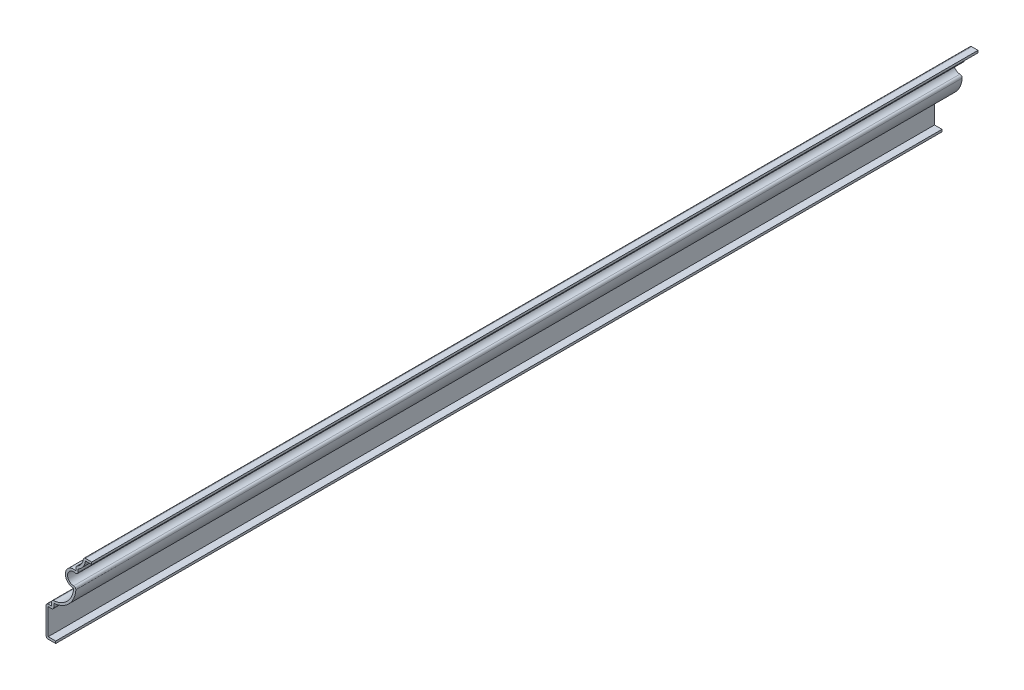
ISO-10303-21;
HEADER;
FILE_DESCRIPTION(('STEP AP214'),'2;1');
FILE_NAME('part.step','',(''),(''),'','','');
FILE_SCHEMA(('AUTOMOTIVE_DESIGN { 1 0 10303 214 1 1 1 1 }'));
ENDSEC;
DATA;
#1=APPLICATION_CONTEXT('core data for automotive mechanical design processes');
#2=APPLICATION_PROTOCOL_DEFINITION('international standard','automotive_design',2000,#1);
#3=PRODUCT_CONTEXT('',#1,'mechanical');
#4=PRODUCT('Part','Part','',(#3));
#5=PRODUCT_RELATED_PRODUCT_CATEGORY('part','',(#4));
#6=PRODUCT_DEFINITION_FORMATION('','',#4);
#7=PRODUCT_DEFINITION_CONTEXT('part definition',#1,'design');
#8=PRODUCT_DEFINITION('design','',#6,#7);
#9=PRODUCT_DEFINITION_SHAPE('','',#8);
#10=(LENGTH_UNIT() NAMED_UNIT(*) SI_UNIT(.MILLI.,.METRE.));
#11=(NAMED_UNIT(*) PLANE_ANGLE_UNIT() SI_UNIT($,.RADIAN.));
#12=(NAMED_UNIT(*) SI_UNIT($,.STERADIAN.) SOLID_ANGLE_UNIT());
#13=UNCERTAINTY_MEASURE_WITH_UNIT(LENGTH_MEASURE(1.E-05),#10,'distance_accuracy_value','');
#14=(GEOMETRIC_REPRESENTATION_CONTEXT(3) GLOBAL_UNCERTAINTY_ASSIGNED_CONTEXT((#13)) GLOBAL_UNIT_ASSIGNED_CONTEXT((#10,
#11,#12)) REPRESENTATION_CONTEXT('',''));
#15=CARTESIAN_POINT('',(0.,0.,0.));
#16=DIRECTION('',(0.,0.,1.));
#17=DIRECTION('',(1.,0.,0.));
#18=AXIS2_PLACEMENT_3D('',#15,#16,#17);
#19=CARTESIAN_POINT('',(15.875,49.53,-508.));
#20=DIRECTION('',(0.,-1.,0.));
#21=DIRECTION('',(0.,0.,-1.));
#22=AXIS2_PLACEMENT_3D('',#19,#20,#21);
#23=PLANE('',#22);
#24=DIRECTION('',(1.,0.,0.));
#25=VECTOR('',#24,1.);
#26=CARTESIAN_POINT('',(15.875,49.53,0.));
#27=LINE('',#26,#25);
#28=CARTESIAN_POINT('',(17.0666574151242,49.53,0.));
#29=VERTEX_POINT('',#28);
#30=CARTESIAN_POINT('',(20.6375,49.53,0.));
#31=VERTEX_POINT('',#30);
#32=EDGE_CURVE('E295',#29,#31,#27,.T.);
#33=ORIENTED_EDGE('',*,*,#32,.F.);
#34=DIRECTION('',(0.,0.,1.));
#35=VECTOR('',#34,1.);
#36=CARTESIAN_POINT('',(17.0666574151242,49.53,-508.));
#37=LINE('',#36,#35);
#38=CARTESIAN_POINT('',(17.0666574151242,49.53,-508.));
#39=VERTEX_POINT('',#38);
#40=EDGE_CURVE('E247',#39,#29,#37,.T.);
#41=ORIENTED_EDGE('',*,*,#40,.F.);
#42=DIRECTION('',(1.,0.,0.));
#43=VECTOR('',#42,1.);
#44=CARTESIAN_POINT('',(15.875,49.53,-508.));
#45=LINE('',#44,#43);
#46=CARTESIAN_POINT('',(20.6375,49.53,-508.));
#47=VERTEX_POINT('',#46);
#48=EDGE_CURVE('E228',#39,#47,#45,.T.);
#49=ORIENTED_EDGE('',*,*,#48,.T.);
#50=DIRECTION('',(0.,0.,1.));
#51=VECTOR('',#50,1.);
#52=CARTESIAN_POINT('',(20.6375,49.53,-508.));
#53=LINE('',#52,#51);
#54=EDGE_CURVE('E237',#47,#31,#53,.T.);
#55=ORIENTED_EDGE('',*,*,#54,.T.);
#56=EDGE_LOOP('',(#33,#41,#49,#55));
#57=FACE_BOUND('',#56,.T.);
#58=ADVANCED_FACE('F35',(#57),#23,.T.);
#59=CARTESIAN_POINT('',(8.9863808914025,50.6671459773409,-508.));
#60=DIRECTION('',(0.,0.,1.));
#61=DIRECTION('',(1.,0.,0.));
#62=AXIS2_PLACEMENT_3D('',#59,#60,#61);
#63=CYLINDRICAL_SURFACE('',#62,8.15990010193699);
#64=CARTESIAN_POINT('',(8.9863808914025,50.6671459773409,0.));
#65=DIRECTION('',(0.,0.,1.));
#66=DIRECTION('',(1.,0.,0.));
#67=AXIS2_PLACEMENT_3D('',#64,#65,#66);
#68=CIRCLE('',#67,8.15990010193699);
#69=CARTESIAN_POINT('',(12.8339210417454,43.4712857462712,0.));
#70=VERTEX_POINT('',#69);
#71=EDGE_CURVE('E248',#70,#29,#68,.T.);
#72=ORIENTED_EDGE('',*,*,#71,.F.);
#73=DIRECTION('',(0.,0.,1.));
#74=VECTOR('',#73,1.);
#75=CARTESIAN_POINT('',(12.8339210417454,43.4712857462712,-508.));
#76=LINE('',#75,#74);
#77=CARTESIAN_POINT('',(12.8339210417454,43.4712857462712,-508.));
#78=VERTEX_POINT('',#77);
#79=EDGE_CURVE('E342',#78,#70,#76,.T.);
#80=ORIENTED_EDGE('',*,*,#79,.F.);
#81=CARTESIAN_POINT('',(8.9863808914025,50.6671459773409,-508.));
#82=DIRECTION('',(0.,0.,1.));
#83=DIRECTION('',(1.,0.,0.));
#84=AXIS2_PLACEMENT_3D('',#81,#82,#83);
#85=CIRCLE('',#84,8.15990010193699);
#86=EDGE_CURVE('E245',#78,#39,#85,.T.);
#87=ORIENTED_EDGE('',*,*,#86,.T.);
#88=ORIENTED_EDGE('',*,*,#40,.T.);
#89=EDGE_LOOP('',(#72,#80,#87,#88));
#90=FACE_BOUND('',#89,.T.);
#91=ADVANCED_FACE('F473',(#90),#63,.T.);
#92=CARTESIAN_POINT('',(12.8339210417454,41.8962942535993,-508.));
#93=DIRECTION('',(1.,0.,0.));
#94=DIRECTION('',(0.,0.,-1.));
#95=AXIS2_PLACEMENT_3D('',#92,#93,#94);
#96=PLANE('',#95);
#97=DIRECTION('',(0.,1.,0.));
#98=VECTOR('',#97,1.);
#99=CARTESIAN_POINT('',(12.8339210417454,41.8962942535993,0.));
#100=LINE('',#99,#98);
#101=CARTESIAN_POINT('',(12.8339210417454,41.8962942535993,0.));
#102=VERTEX_POINT('',#101);
#103=EDGE_CURVE('E251',#102,#70,#100,.T.);
#104=ORIENTED_EDGE('',*,*,#103,.F.);
#105=DIRECTION('',(0.,0.,1.));
#106=VECTOR('',#105,1.);
#107=CARTESIAN_POINT('',(12.8339210417454,41.8962942535993,-508.));
#108=LINE('',#107,#106);
#109=CARTESIAN_POINT('',(12.8339210417454,41.8962942535993,-508.));
#110=VERTEX_POINT('',#109);
#111=EDGE_CURVE('E411',#102,#110,#108,.F.);
#112=ORIENTED_EDGE('',*,*,#111,.T.);
#113=DIRECTION('',(0.,1.,0.));
#114=VECTOR('',#113,1.);
#115=CARTESIAN_POINT('',(12.8339210417454,41.8962942535993,-508.));
#116=LINE('',#115,#114);
#117=EDGE_CURVE('E292',#110,#78,#116,.T.);
#118=ORIENTED_EDGE('',*,*,#117,.T.);
#119=ORIENTED_EDGE('',*,*,#79,.T.);
#120=EDGE_LOOP('',(#104,#112,#118,#119));
#121=FACE_BOUND('',#120,.T.);
#122=ADVANCED_FACE('F553',(#121),#96,.T.);
#123=CARTESIAN_POINT('',(10.2939210417454,37.30625,-508.));
#124=DIRECTION('',(0.,0.,1.));
#125=DIRECTION('',(1.,0.,0.));
#126=AXIS2_PLACEMENT_3D('',#123,#124,#125);
#127=CYLINDRICAL_SURFACE('',#126,3.4925);
#128=CARTESIAN_POINT('',(10.2939210417454,37.30625,-508.));
#129=DIRECTION('',(0.,0.,1.));
#130=DIRECTION('',(1.,0.,0.));
#131=AXIS2_PLACEMENT_3D('',#128,#129,#130);
#132=CIRCLE('',#131,3.4925);
#133=CARTESIAN_POINT('',(10.2939210417454,33.81375,-508.));
#134=VERTEX_POINT('',#133);
#135=CARTESIAN_POINT('',(11.2252543750787,40.6722824526395,-508.));
#136=VERTEX_POINT('',#135);
#137=EDGE_CURVE('E289',#134,#136,#132,.F.);
#138=ORIENTED_EDGE('',*,*,#137,.T.);
#139=DIRECTION('',(0.,0.,1.));
#140=VECTOR('',#139,1.);
#141=CARTESIAN_POINT('',(11.2252543750787,40.6722824526395,-508.));
#142=LINE('',#141,#140);
#143=CARTESIAN_POINT('',(11.2252543750787,40.6722824526395,0.));
#144=VERTEX_POINT('',#143);
#145=EDGE_CURVE('E408',#136,#144,#142,.T.);
#146=ORIENTED_EDGE('',*,*,#145,.T.);
#147=CARTESIAN_POINT('',(10.2939210417454,37.30625,0.));
#148=DIRECTION('',(0.,0.,1.));
#149=DIRECTION('',(1.,0.,0.));
#150=AXIS2_PLACEMENT_3D('',#147,#148,#149);
#151=CIRCLE('',#150,3.4925);
#152=CARTESIAN_POINT('',(10.2939210417454,33.81375,0.));
#153=VERTEX_POINT('',#152);
#154=EDGE_CURVE('E336',#153,#144,#151,.F.);
#155=ORIENTED_EDGE('',*,*,#154,.F.);
#156=DIRECTION('',(0.,0.,1.));
#157=VECTOR('',#156,1.);
#158=CARTESIAN_POINT('',(10.2939210417454,33.81375,-508.));
#159=LINE('',#158,#157);
#160=EDGE_CURVE('E406',#153,#134,#159,.F.);
#161=ORIENTED_EDGE('',*,*,#160,.T.);
#162=EDGE_LOOP('',(#138,#146,#155,#161));
#163=FACE_BOUND('',#162,.T.);
#164=ADVANCED_FACE('F484',(#163),#127,.F.);
#165=CARTESIAN_POINT('',(-2.38125,33.3375,-508.));
#166=DIRECTION('',(0.,0.,1.));
#167=DIRECTION('',(1.,0.,0.));
#168=AXIS2_PLACEMENT_3D('',#165,#166,#167);
#169=CYLINDRICAL_SURFACE('',#168,13.97);
#170=CARTESIAN_POINT('',(-2.38125,33.3375,-508.));
#171=DIRECTION('',(0.,0.,1.));
#172=DIRECTION('',(1.,0.,0.));
#173=AXIS2_PLACEMENT_3D('',#170,#171,#172);
#174=CIRCLE('',#173,13.97);
#175=CARTESIAN_POINT('',(-1.11125,19.4253470393688,-508.));
#176=VERTEX_POINT('',#175);
#177=CARTESIAN_POINT('',(11.5614381459199,32.464375,-508.));
#178=VERTEX_POINT('',#177);
#179=EDGE_CURVE('E286',#176,#178,#174,.T.);
#180=ORIENTED_EDGE('',*,*,#179,.T.);
#181=DIRECTION('',(0.,0.,1.));
#182=VECTOR('',#181,1.);
#183=CARTESIAN_POINT('',(11.5614381459199,32.464375,-508.));
#184=LINE('',#183,#182);
#185=CARTESIAN_POINT('',(11.5614381459199,32.464375,0.));
#186=VERTEX_POINT('',#185);
#187=EDGE_CURVE('E413',#178,#186,#184,.T.);
#188=ORIENTED_EDGE('',*,*,#187,.T.);
#189=CARTESIAN_POINT('',(-2.38125,33.3375,0.));
#190=DIRECTION('',(0.,0.,1.));
#191=DIRECTION('',(1.,0.,0.));
#192=AXIS2_PLACEMENT_3D('',#189,#190,#191);
#193=CIRCLE('',#192,13.97);
#194=CARTESIAN_POINT('',(-1.11125,19.4253470393688,0.));
#195=VERTEX_POINT('',#194);
#196=EDGE_CURVE('E333',#195,#186,#193,.T.);
#197=ORIENTED_EDGE('',*,*,#196,.F.);
#198=DIRECTION('',(0.,0.,1.));
#199=VECTOR('',#198,1.);
#200=CARTESIAN_POINT('',(-1.11125,19.4253470393688,-508.));
#201=LINE('',#200,#199);
#202=EDGE_CURVE('E345',#176,#195,#201,.T.);
#203=ORIENTED_EDGE('',*,*,#202,.F.);
#204=EDGE_LOOP('',(#180,#188,#197,#203));
#205=FACE_BOUND('',#204,.T.);
#206=ADVANCED_FACE('F492',(#205),#169,.T.);
#207=CARTESIAN_POINT('',(-1.11125,17.4625,-508.));
#208=DIRECTION('',(1.,0.,0.));
#209=DIRECTION('',(0.,0.,-1.));
#210=AXIS2_PLACEMENT_3D('',#207,#208,#209);
#211=PLANE('',#210);
#212=DIRECTION('',(0.,1.,0.));
#213=VECTOR('',#212,1.);
#214=CARTESIAN_POINT('',(-1.11125,17.4625,0.));
#215=LINE('',#214,#213);
#216=CARTESIAN_POINT('',(-1.11125,17.4625,0.));
#217=VERTEX_POINT('',#216);
#218=EDGE_CURVE('E331',#217,#195,#215,.T.);
#219=ORIENTED_EDGE('',*,*,#218,.F.);
#220=DIRECTION('',(0.,0.,1.));
#221=VECTOR('',#220,1.);
#222=CARTESIAN_POINT('',(-1.11125,17.4625,-508.));
#223=LINE('',#222,#221);
#224=CARTESIAN_POINT('',(-1.11125,17.4625,-508.));
#225=VERTEX_POINT('',#224);
#226=EDGE_CURVE('E426',#217,#225,#223,.F.);
#227=ORIENTED_EDGE('',*,*,#226,.T.);
#228=DIRECTION('',(0.,1.,0.));
#229=VECTOR('',#228,1.);
#230=CARTESIAN_POINT('',(-1.11125,17.4625,-508.));
#231=LINE('',#230,#229);
#232=EDGE_CURVE('E284',#225,#176,#231,.T.);
#233=ORIENTED_EDGE('',*,*,#232,.T.);
#234=ORIENTED_EDGE('',*,*,#202,.T.);
#235=EDGE_LOOP('',(#219,#227,#233,#234));
#236=FACE_BOUND('',#235,.T.);
#237=ADVANCED_FACE('F702',(#236),#211,.T.);
#238=CARTESIAN_POINT('',(-5.55625,16.1925,-508.));
#239=DIRECTION('',(0.,-1.,0.));
#240=DIRECTION('',(0.,0.,-1.));
#241=AXIS2_PLACEMENT_3D('',#238,#239,#240);
#242=PLANE('',#241);
#243=DIRECTION('',(1.,0.,0.));
#244=VECTOR('',#243,1.);
#245=CARTESIAN_POINT('',(-5.55625,16.1925,-508.));
#246=LINE('',#245,#244);
#247=CARTESIAN_POINT('',(-4.28625,16.1925,-508.));
#248=VERTEX_POINT('',#247);
#249=CARTESIAN_POINT('',(-2.38125,16.1925,-508.));
#250=VERTEX_POINT('',#249);
#251=EDGE_CURVE('E281',#248,#250,#246,.T.);
#252=ORIENTED_EDGE('',*,*,#251,.T.);
#253=DIRECTION('',(0.,0.,1.));
#254=VECTOR('',#253,1.);
#255=CARTESIAN_POINT('',(-2.38125,16.1925,-508.));
#256=LINE('',#255,#254);
#257=CARTESIAN_POINT('',(-2.38125,16.1925,0.));
#258=VERTEX_POINT('',#257);
#259=EDGE_CURVE('E423',#250,#258,#256,.T.);
#260=ORIENTED_EDGE('',*,*,#259,.T.);
#261=DIRECTION('',(1.,0.,0.));
#262=VECTOR('',#261,1.);
#263=CARTESIAN_POINT('',(-5.55625,16.1925,0.));
#264=LINE('',#263,#262);
#265=CARTESIAN_POINT('',(-4.28625,16.1925,0.));
#266=VERTEX_POINT('',#265);
#267=EDGE_CURVE('E328',#266,#258,#264,.T.);
#268=ORIENTED_EDGE('',*,*,#267,.F.);
#269=DIRECTION('',(0.,0.,1.));
#270=VECTOR('',#269,1.);
#271=CARTESIAN_POINT('',(-4.28625,16.1925,-508.));
#272=LINE('',#271,#270);
#273=EDGE_CURVE('E348',#248,#266,#272,.T.);
#274=ORIENTED_EDGE('',*,*,#273,.F.);
#275=EDGE_LOOP('',(#252,#260,#268,#274));
#276=FACE_BOUND('',#275,.T.);
#277=ADVANCED_FACE('F505',(#276),#242,.T.);
#278=CARTESIAN_POINT('',(-4.28625,0.,-508.));
#279=DIRECTION('',(1.,0.,0.));
#280=DIRECTION('',(0.,0.,-1.));
#281=AXIS2_PLACEMENT_3D('',#278,#279,#280);
#282=PLANE('',#281);
#283=DIRECTION('',(0.,1.,0.));
#284=VECTOR('',#283,1.);
#285=CARTESIAN_POINT('',(-4.28625,0.,0.));
#286=LINE('',#285,#284);
#287=CARTESIAN_POINT('',(-4.28625,1.27,0.));
#288=VERTEX_POINT('',#287);
#289=EDGE_CURVE('E325',#288,#266,#286,.T.);
#290=ORIENTED_EDGE('',*,*,#289,.F.);
#291=DIRECTION('',(0.,0.,1.));
#292=VECTOR('',#291,1.);
#293=CARTESIAN_POINT('',(-4.28625,1.27,-508.));
#294=LINE('',#293,#292);
#295=CARTESIAN_POINT('',(-4.28625,1.27,-508.));
#296=VERTEX_POINT('',#295);
#297=EDGE_CURVE('E350',#296,#288,#294,.T.);
#298=ORIENTED_EDGE('',*,*,#297,.F.);
#299=DIRECTION('',(0.,1.,0.));
#300=VECTOR('',#299,1.);
#301=CARTESIAN_POINT('',(-4.28625,0.,-508.));
#302=LINE('',#301,#300);
#303=EDGE_CURVE('E278',#296,#248,#302,.T.);
#304=ORIENTED_EDGE('',*,*,#303,.T.);
#305=ORIENTED_EDGE('',*,*,#273,.T.);
#306=EDGE_LOOP('',(#290,#298,#304,#305));
#307=FACE_BOUND('',#306,.T.);
#308=ADVANCED_FACE('F511',(#307),#282,.T.);
#309=CARTESIAN_POINT('',(0.,1.27,-508.));
#310=DIRECTION('',(0.,1.,0.));
#311=DIRECTION('',(-1.,0.,0.));
#312=AXIS2_PLACEMENT_3D('',#309,#310,#311);
#313=PLANE('',#312);
#314=DIRECTION('',(-1.,0.,0.));
#315=VECTOR('',#314,1.);
#316=CARTESIAN_POINT('',(0.,1.27,0.));
#317=LINE('',#316,#315);
#318=CARTESIAN_POINT('',(0.,1.27,0.));
#319=VERTEX_POINT('',#318);
#320=EDGE_CURVE('E322',#319,#288,#317,.T.);
#321=ORIENTED_EDGE('',*,*,#320,.F.);
#322=DIRECTION('',(0.,0.,1.));
#323=VECTOR('',#322,1.);
#324=CARTESIAN_POINT('',(0.,1.27,-508.));
#325=LINE('',#324,#323);
#326=CARTESIAN_POINT('',(0.,1.27,-508.));
#327=VERTEX_POINT('',#326);
#328=EDGE_CURVE('E352',#327,#319,#325,.T.);
#329=ORIENTED_EDGE('',*,*,#328,.F.);
#330=DIRECTION('',(-1.,0.,0.));
#331=VECTOR('',#330,1.);
#332=CARTESIAN_POINT('',(0.,1.27,-508.));
#333=LINE('',#332,#331);
#334=EDGE_CURVE('E275',#327,#296,#333,.T.);
#335=ORIENTED_EDGE('',*,*,#334,.T.);
#336=ORIENTED_EDGE('',*,*,#297,.T.);
#337=EDGE_LOOP('',(#321,#329,#335,#336));
#338=FACE_BOUND('',#337,.T.);
#339=ADVANCED_FACE('F515',(#338),#313,.T.);
#340=CARTESIAN_POINT('',(0.,1.27,-508.));
#341=DIRECTION('',(-1.,0.,0.));
#342=DIRECTION('',(0.,-1.,0.));
#343=AXIS2_PLACEMENT_3D('',#340,#341,#342);
#344=PLANE('',#343);
#345=DIRECTION('',(0.,-1.,0.));
#346=VECTOR('',#345,1.);
#347=CARTESIAN_POINT('',(0.,1.27,0.));
#348=LINE('',#347,#346);
#349=CARTESIAN_POINT('',(0.,0.,0.));
#350=VERTEX_POINT('',#349);
#351=EDGE_CURVE('E320',#319,#350,#348,.T.);
#352=ORIENTED_EDGE('',*,*,#351,.T.);
#353=DIRECTION('',(0.,0.,1.));
#354=VECTOR('',#353,1.);
#355=CARTESIAN_POINT('',(0.,0.,-508.));
#356=LINE('',#355,#354);
#357=CARTESIAN_POINT('',(0.,0.,-508.));
#358=VERTEX_POINT('',#357);
#359=EDGE_CURVE('E354',#358,#350,#356,.T.);
#360=ORIENTED_EDGE('',*,*,#359,.F.);
#361=DIRECTION('',(0.,-1.,0.));
#362=VECTOR('',#361,1.);
#363=CARTESIAN_POINT('',(0.,1.27,-508.));
#364=LINE('',#363,#362);
#365=EDGE_CURVE('E273',#327,#358,#364,.T.);
#366=ORIENTED_EDGE('',*,*,#365,.F.);
#367=ORIENTED_EDGE('',*,*,#328,.T.);
#368=EDGE_LOOP('',(#352,#360,#366,#367));
#369=FACE_BOUND('',#368,.T.);
#370=ADVANCED_FACE('F519',(#369),#344,.F.);
#371=CARTESIAN_POINT('',(0.,0.,-508.));
#372=DIRECTION('',(0.,1.,0.));
#373=DIRECTION('',(-1.,0.,0.));
#374=AXIS2_PLACEMENT_3D('',#371,#372,#373);
#375=PLANE('',#374);
#376=DIRECTION('',(-1.,0.,0.));
#377=VECTOR('',#376,1.);
#378=CARTESIAN_POINT('',(0.,0.,0.));
#379=LINE('',#378,#377);
#380=CARTESIAN_POINT('',(-4.28625,0.,0.));
#381=VERTEX_POINT('',#380);
#382=EDGE_CURVE('E317',#350,#381,#379,.T.);
#383=ORIENTED_EDGE('',*,*,#382,.T.);
#384=DIRECTION('',(0.,0.,1.));
#385=VECTOR('',#384,1.);
#386=CARTESIAN_POINT('',(-4.28625,0.,-508.));
#387=LINE('',#386,#385);
#388=CARTESIAN_POINT('',(-4.28625,0.,-508.));
#389=VERTEX_POINT('',#388);
#390=EDGE_CURVE('E421',#381,#389,#387,.F.);
#391=ORIENTED_EDGE('',*,*,#390,.T.);
#392=DIRECTION('',(-1.,0.,0.));
#393=VECTOR('',#392,1.);
#394=CARTESIAN_POINT('',(0.,0.,-508.));
#395=LINE('',#394,#393);
#396=EDGE_CURVE('E270',#358,#389,#395,.T.);
#397=ORIENTED_EDGE('',*,*,#396,.F.);
#398=ORIENTED_EDGE('',*,*,#359,.T.);
#399=EDGE_LOOP('',(#383,#391,#397,#398));
#400=FACE_BOUND('',#399,.T.);
#401=ADVANCED_FACE('F546',(#400),#375,.F.);
#402=CARTESIAN_POINT('',(-5.55625,0.,-508.));
#403=DIRECTION('',(1.,0.,0.));
#404=DIRECTION('',(0.,0.,-1.));
#405=AXIS2_PLACEMENT_3D('',#402,#403,#404);
#406=PLANE('',#405);
#407=DIRECTION('',(0.,1.,0.));
#408=VECTOR('',#407,1.);
#409=CARTESIAN_POINT('',(-5.55625,0.,-508.));
#410=LINE('',#409,#408);
#411=CARTESIAN_POINT('',(-5.55625,1.27,-508.));
#412=VERTEX_POINT('',#411);
#413=CARTESIAN_POINT('',(-5.55625,16.1925,-508.));
#414=VERTEX_POINT('',#413);
#415=EDGE_CURVE('E267',#412,#414,#410,.T.);
#416=ORIENTED_EDGE('',*,*,#415,.F.);
#417=DIRECTION('',(0.,0.,1.));
#418=VECTOR('',#417,1.);
#419=CARTESIAN_POINT('',(-5.55625,1.27,-508.));
#420=LINE('',#419,#418);
#421=CARTESIAN_POINT('',(-5.55625,1.27,0.));
#422=VERTEX_POINT('',#421);
#423=EDGE_CURVE('E418',#412,#422,#420,.T.);
#424=ORIENTED_EDGE('',*,*,#423,.T.);
#425=DIRECTION('',(0.,1.,0.));
#426=VECTOR('',#425,1.);
#427=CARTESIAN_POINT('',(-5.55625,0.,0.));
#428=LINE('',#427,#426);
#429=CARTESIAN_POINT('',(-5.55625,16.1925,0.));
#430=VERTEX_POINT('',#429);
#431=EDGE_CURVE('E314',#422,#430,#428,.T.);
#432=ORIENTED_EDGE('',*,*,#431,.T.);
#433=DIRECTION('',(0.,0.,1.));
#434=VECTOR('',#433,1.);
#435=CARTESIAN_POINT('',(-5.55625,16.1925,-508.));
#436=LINE('',#435,#434);
#437=EDGE_CURVE('E416',#430,#414,#436,.F.);
#438=ORIENTED_EDGE('',*,*,#437,.T.);
#439=EDGE_LOOP('',(#416,#424,#432,#438));
#440=FACE_BOUND('',#439,.T.);
#441=ADVANCED_FACE('F530',(#440),#406,.F.);
#442=CARTESIAN_POINT('',(-5.55625,17.4625,-508.));
#443=DIRECTION('',(0.,-1.,0.));
#444=DIRECTION('',(0.,0.,-1.));
#445=AXIS2_PLACEMENT_3D('',#442,#443,#444);
#446=PLANE('',#445);
#447=DIRECTION('',(1.,0.,0.));
#448=VECTOR('',#447,1.);
#449=CARTESIAN_POINT('',(-5.55625,17.4625,-508.));
#450=LINE('',#449,#448);
#451=CARTESIAN_POINT('',(-4.28625,17.4625,-508.));
#452=VERTEX_POINT('',#451);
#453=CARTESIAN_POINT('',(-2.38125,17.4625,-508.));
#454=VERTEX_POINT('',#453);
#455=EDGE_CURVE('E265',#452,#454,#450,.T.);
#456=ORIENTED_EDGE('',*,*,#455,.F.);
#457=DIRECTION('',(0.,0.,1.));
#458=VECTOR('',#457,1.);
#459=CARTESIAN_POINT('',(-4.28625,17.4625,-508.));
#460=LINE('',#459,#458);
#461=CARTESIAN_POINT('',(-4.28625,17.4625,0.));
#462=VERTEX_POINT('',#461);
#463=EDGE_CURVE('E11',#452,#462,#460,.T.);
#464=ORIENTED_EDGE('',*,*,#463,.T.);
#465=DIRECTION('',(1.,0.,0.));
#466=VECTOR('',#465,1.);
#467=CARTESIAN_POINT('',(-5.55625,17.4625,0.));
#468=LINE('',#467,#466);
#469=CARTESIAN_POINT('',(-2.38125,17.4625,0.));
#470=VERTEX_POINT('',#469);
#471=EDGE_CURVE('E312',#462,#470,#468,.T.);
#472=ORIENTED_EDGE('',*,*,#471,.T.);
#473=DIRECTION('',(0.,0.,1.));
#474=VECTOR('',#473,1.);
#475=CARTESIAN_POINT('',(-2.38125,17.4625,-508.));
#476=LINE('',#475,#474);
#477=EDGE_CURVE('E357',#454,#470,#476,.T.);
#478=ORIENTED_EDGE('',*,*,#477,.F.);
#479=EDGE_LOOP('',(#456,#464,#472,#478));
#480=FACE_BOUND('',#479,.T.);
#481=ADVANCED_FACE('F538',(#480),#446,.F.);
#482=CARTESIAN_POINT('',(-2.38125,17.4625,-508.));
#483=DIRECTION('',(1.,0.,0.));
#484=DIRECTION('',(0.,0.,-1.));
#485=AXIS2_PLACEMENT_3D('',#482,#483,#484);
#486=PLANE('',#485);
#487=DIRECTION('',(0.,1.,0.));
#488=VECTOR('',#487,1.);
#489=CARTESIAN_POINT('',(-2.38125,17.4625,0.));
#490=LINE('',#489,#488);
#491=CARTESIAN_POINT('',(-2.38125,19.4253470393688,0.));
#492=VERTEX_POINT('',#491);
#493=EDGE_CURVE('E309',#470,#492,#490,.T.);
#494=ORIENTED_EDGE('',*,*,#493,.T.);
#495=DIRECTION('',(0.,0.,1.));
#496=VECTOR('',#495,1.);
#497=CARTESIAN_POINT('',(-2.38125,19.4253470393688,-508.));
#498=LINE('',#497,#496);
#499=CARTESIAN_POINT('',(-2.38125,19.4253470393688,-508.));
#500=VERTEX_POINT('',#499);
#501=EDGE_CURVE('E43',#492,#500,#498,.F.);
#502=ORIENTED_EDGE('',*,*,#501,.T.);
#503=DIRECTION('',(0.,1.,0.));
#504=VECTOR('',#503,1.);
#505=CARTESIAN_POINT('',(-2.38125,17.4625,-508.));
#506=LINE('',#505,#504);
#507=EDGE_CURVE('E263',#454,#500,#506,.T.);
#508=ORIENTED_EDGE('',*,*,#507,.F.);
#509=ORIENTED_EDGE('',*,*,#477,.T.);
#510=EDGE_LOOP('',(#494,#502,#508,#509));
#511=FACE_BOUND('',#510,.T.);
#512=ADVANCED_FACE('F433',(#511),#486,.F.);
#513=CARTESIAN_POINT('',(-2.38125,33.3375,-508.));
#514=DIRECTION('',(0.,0.,1.));
#515=DIRECTION('',(1.,0.,0.));
#516=AXIS2_PLACEMENT_3D('',#513,#514,#515);
#517=CYLINDRICAL_SURFACE('',#516,12.7);
#518=CARTESIAN_POINT('',(-2.38125,33.3375,-508.));
#519=DIRECTION('',(0.,0.,1.));
#520=DIRECTION('',(1.,0.,0.));
#521=AXIS2_PLACEMENT_3D('',#518,#519,#520);
#522=CIRCLE('',#521,12.7);
#523=CARTESIAN_POINT('',(-1.22670454545454,20.690088217608,-508.));
#524=VERTEX_POINT('',#523);
#525=CARTESIAN_POINT('',(10.2939210417454,32.54375,-508.));
#526=VERTEX_POINT('',#525);
#527=EDGE_CURVE('E261',#524,#526,#522,.T.);
#528=ORIENTED_EDGE('',*,*,#527,.F.);
#529=DIRECTION('',(0.,0.,1.));
#530=VECTOR('',#529,1.);
#531=CARTESIAN_POINT('',(-1.22670454545454,20.690088217608,-508.));
#532=LINE('',#531,#530);
#533=CARTESIAN_POINT('',(-1.22670454545454,20.690088217608,0.));
#534=VERTEX_POINT('',#533);
#535=EDGE_CURVE('E428',#524,#534,#532,.T.);
#536=ORIENTED_EDGE('',*,*,#535,.T.);
#537=CARTESIAN_POINT('',(-2.38125,33.3375,0.));
#538=DIRECTION('',(0.,0.,1.));
#539=DIRECTION('',(1.,0.,0.));
#540=AXIS2_PLACEMENT_3D('',#537,#538,#539);
#541=CIRCLE('',#540,12.7);
#542=CARTESIAN_POINT('',(10.2939210417454,32.54375,0.));
#543=VERTEX_POINT('',#542);
#544=EDGE_CURVE('E307',#534,#543,#541,.T.);
#545=ORIENTED_EDGE('',*,*,#544,.T.);
#546=DIRECTION('',(0.,0.,1.));
#547=VECTOR('',#546,1.);
#548=CARTESIAN_POINT('',(10.2939210417454,32.54375,-508.));
#549=LINE('',#548,#547);
#550=EDGE_CURVE('E360',#526,#543,#549,.T.);
#551=ORIENTED_EDGE('',*,*,#550,.F.);
#552=EDGE_LOOP('',(#528,#536,#545,#551));
#553=FACE_BOUND('',#552,.T.);
#554=ADVANCED_FACE('F442',(#553),#517,.F.);
#555=CARTESIAN_POINT('',(10.2939210417454,37.30625,-508.));
#556=DIRECTION('',(0.,0.,1.));
#557=DIRECTION('',(1.,0.,0.));
#558=AXIS2_PLACEMENT_3D('',#555,#556,#557);
#559=CYLINDRICAL_SURFACE('',#558,4.7625);
#560=CARTESIAN_POINT('',(10.2939210417454,37.30625,0.));
#561=DIRECTION('',(0.,0.,-1.));
#562=DIRECTION('',(1.,0.,0.));
#563=AXIS2_PLACEMENT_3D('',#560,#561,#562);
#564=CIRCLE('',#563,4.7625);
#565=CARTESIAN_POINT('',(11.5639210417454,41.8962942535993,0.));
#566=VERTEX_POINT('',#565);
#567=EDGE_CURVE('E305',#543,#566,#564,.T.);
#568=ORIENTED_EDGE('',*,*,#567,.T.);
#569=DIRECTION('',(0.,0.,1.));
#570=VECTOR('',#569,1.);
#571=CARTESIAN_POINT('',(11.5639210417454,41.8962942535993,-508.));
#572=LINE('',#571,#570);
#573=CARTESIAN_POINT('',(11.5639210417454,41.8962942535993,-508.));
#574=VERTEX_POINT('',#573);
#575=EDGE_CURVE('E363',#574,#566,#572,.T.);
#576=ORIENTED_EDGE('',*,*,#575,.F.);
#577=CARTESIAN_POINT('',(10.2939210417454,37.30625,-508.));
#578=DIRECTION('',(0.,0.,-1.));
#579=DIRECTION('',(1.,0.,0.));
#580=AXIS2_PLACEMENT_3D('',#577,#578,#579);
#581=CIRCLE('',#580,4.7625);
#582=EDGE_CURVE('E259',#526,#574,#581,.T.);
#583=ORIENTED_EDGE('',*,*,#582,.F.);
#584=ORIENTED_EDGE('',*,*,#550,.T.);
#585=EDGE_LOOP('',(#568,#576,#583,#584));
#586=FACE_BOUND('',#585,.T.);
#587=ADVANCED_FACE('F451',(#586),#559,.T.);
#588=CARTESIAN_POINT('',(11.5639210417454,41.8962942535993,-508.));
#589=DIRECTION('',(1.,0.,0.));
#590=DIRECTION('',(0.,0.,-1.));
#591=AXIS2_PLACEMENT_3D('',#588,#589,#590);
#592=PLANE('',#591);
#593=DIRECTION('',(0.,1.,0.));
#594=VECTOR('',#593,1.);
#595=CARTESIAN_POINT('',(11.5639210417454,41.8962942535993,0.));
#596=LINE('',#595,#594);
#597=CARTESIAN_POINT('',(11.5639210417454,43.4712857462712,0.));
#598=VERTEX_POINT('',#597);
#599=EDGE_CURVE('E303',#566,#598,#596,.T.);
#600=ORIENTED_EDGE('',*,*,#599,.T.);
#601=DIRECTION('',(0.,0.,1.));
#602=VECTOR('',#601,1.);
#603=CARTESIAN_POINT('',(11.5639210417454,43.4712857462712,-508.));
#604=LINE('',#603,#602);
#605=CARTESIAN_POINT('',(11.5639210417454,43.4712857462712,-508.));
#606=VERTEX_POINT('',#605);
#607=EDGE_CURVE('E50',#598,#606,#604,.F.);
#608=ORIENTED_EDGE('',*,*,#607,.T.);
#609=DIRECTION('',(0.,1.,0.));
#610=VECTOR('',#609,1.);
#611=CARTESIAN_POINT('',(11.5639210417454,41.8962942535993,-508.));
#612=LINE('',#611,#610);
#613=EDGE_CURVE('E257',#574,#606,#612,.T.);
#614=ORIENTED_EDGE('',*,*,#613,.F.);
#615=ORIENTED_EDGE('',*,*,#575,.T.);
#616=EDGE_LOOP('',(#600,#608,#614,#615));
#617=FACE_BOUND('',#616,.T.);
#618=ADVANCED_FACE('F453',(#617),#592,.F.);
#619=CARTESIAN_POINT('',(8.9863808914025,50.6671459773409,-508.));
#620=DIRECTION('',(0.,0.,1.));
#621=DIRECTION('',(1.,0.,0.));
#622=AXIS2_PLACEMENT_3D('',#619,#620,#621);
#623=CYLINDRICAL_SURFACE('',#622,6.88990010193699);
#624=CARTESIAN_POINT('',(8.9863808914025,50.6671459773409,0.));
#625=DIRECTION('',(0.,0.,1.));
#626=DIRECTION('',(1.,0.,0.));
#627=AXIS2_PLACEMENT_3D('',#624,#625,#626);
#628=CIRCLE('',#627,6.88990010193699);
#629=CARTESIAN_POINT('',(12.2350931235242,44.5912433902734,0.));
#630=VERTEX_POINT('',#629);
#631=CARTESIAN_POINT('',(15.8090499619778,49.7069844450522,0.));
#632=VERTEX_POINT('',#631);
#633=EDGE_CURVE('E300',#630,#632,#628,.T.);
#634=ORIENTED_EDGE('',*,*,#633,.T.);
#635=DIRECTION('',(0.,0.,1.));
#636=VECTOR('',#635,1.);
#637=CARTESIAN_POINT('',(15.8090499619778,49.7069844450522,-508.));
#638=LINE('',#637,#636);
#639=CARTESIAN_POINT('',(15.8090499619778,49.7069844450522,-508.));
#640=VERTEX_POINT('',#639);
#641=EDGE_CURVE('E388',#632,#640,#638,.F.);
#642=ORIENTED_EDGE('',*,*,#641,.T.);
#643=CARTESIAN_POINT('',(8.9863808914025,50.6671459773409,-508.));
#644=DIRECTION('',(0.,0.,1.));
#645=DIRECTION('',(1.,0.,0.));
#646=AXIS2_PLACEMENT_3D('',#643,#644,#645);
#647=CIRCLE('',#646,6.88990010193699);
#648=CARTESIAN_POINT('',(12.2350931235242,44.5912433902734,-508.));
#649=VERTEX_POINT('',#648);
#650=EDGE_CURVE('E255',#649,#640,#647,.T.);
#651=ORIENTED_EDGE('',*,*,#650,.F.);
#652=DIRECTION('',(0.,0.,1.));
#653=VECTOR('',#652,1.);
#654=CARTESIAN_POINT('',(12.2350931235242,44.5912433902734,-508.));
#655=LINE('',#654,#653);
#656=EDGE_CURVE('E385',#649,#630,#655,.T.);
#657=ORIENTED_EDGE('',*,*,#656,.T.);
#658=EDGE_LOOP('',(#634,#642,#651,#657));
#659=FACE_BOUND('',#658,.T.);
#660=ADVANCED_FACE('F461',(#659),#623,.F.);
#661=CARTESIAN_POINT('',(15.875,50.8,-508.));
#662=DIRECTION('',(0.,-1.,0.));
#663=DIRECTION('',(0.,0.,-1.));
#664=AXIS2_PLACEMENT_3D('',#661,#662,#663);
#665=PLANE('',#664);
#666=DIRECTION('',(1.,0.,0.));
#667=VECTOR('',#666,1.);
#668=CARTESIAN_POINT('',(15.875,50.8,-508.));
#669=LINE('',#668,#667);
#670=CARTESIAN_POINT('',(17.0666574151242,50.8,-508.));
#671=VERTEX_POINT('',#670);
#672=CARTESIAN_POINT('',(20.6375,50.8,-508.));
#673=VERTEX_POINT('',#672);
#674=EDGE_CURVE('E231',#671,#673,#669,.T.);
#675=ORIENTED_EDGE('',*,*,#674,.F.);
#676=DIRECTION('',(0.,0.,1.));
#677=VECTOR('',#676,1.);
#678=CARTESIAN_POINT('',(17.0666574151242,50.8,-508.));
#679=LINE('',#678,#677);
#680=CARTESIAN_POINT('',(17.0666574151242,50.8,0.));
#681=VERTEX_POINT('',#680);
#682=EDGE_CURVE('E341',#671,#681,#679,.T.);
#683=ORIENTED_EDGE('',*,*,#682,.T.);
#684=DIRECTION('',(1.,0.,0.));
#685=VECTOR('',#684,1.);
#686=CARTESIAN_POINT('',(15.875,50.8,0.));
#687=LINE('',#686,#685);
#688=CARTESIAN_POINT('',(20.6375,50.8,0.));
#689=VERTEX_POINT('',#688);
#690=EDGE_CURVE('E298',#681,#689,#687,.T.);
#691=ORIENTED_EDGE('',*,*,#690,.T.);
#692=DIRECTION('',(0.,0.,1.));
#693=VECTOR('',#692,1.);
#694=CARTESIAN_POINT('',(20.6375,50.8,-508.));
#695=LINE('',#694,#693);
#696=EDGE_CURVE('E244',#673,#689,#695,.T.);
#697=ORIENTED_EDGE('',*,*,#696,.F.);
#698=EDGE_LOOP('',(#675,#683,#691,#697));
#699=FACE_BOUND('',#698,.T.);
#700=ADVANCED_FACE('F468',(#699),#665,.F.);
#701=CARTESIAN_POINT('',(20.6375,50.8,-508.));
#702=DIRECTION('',(-1.,0.,0.));
#703=DIRECTION('',(0.,0.,1.));
#704=AXIS2_PLACEMENT_3D('',#701,#702,#703);
#705=PLANE('',#704);
#706=DIRECTION('',(0.,-1.,0.));
#707=VECTOR('',#706,1.);
#708=CARTESIAN_POINT('',(20.6375,50.8,0.));
#709=LINE('',#708,#707);
#710=EDGE_CURVE('E240',#689,#31,#709,.T.);
#711=ORIENTED_EDGE('',*,*,#710,.T.);
#712=ORIENTED_EDGE('',*,*,#54,.F.);
#713=DIRECTION('',(0.,-1.,0.));
#714=VECTOR('',#713,1.);
#715=CARTESIAN_POINT('',(20.6375,50.8,-508.));
#716=LINE('',#715,#714);
#717=EDGE_CURVE('E222',#673,#47,#716,.T.);
#718=ORIENTED_EDGE('',*,*,#717,.F.);
#719=ORIENTED_EDGE('',*,*,#696,.T.);
#720=EDGE_LOOP('',(#711,#712,#718,#719));
#721=FACE_BOUND('',#720,.T.);
#722=ADVANCED_FACE('F238',(#721),#705,.F.);
#723=CARTESIAN_POINT('',(8.9863808914025,50.6671459773409,-508.));
#724=DIRECTION('',(0.,0.,1.));
#725=DIRECTION('',(1.,0.,0.));
#726=AXIS2_PLACEMENT_3D('',#723,#724,#725);
#727=PLANE('',#726);
#728=ORIENTED_EDGE('',*,*,#650,.T.);
#729=CARTESIAN_POINT('',(17.0666574151242,49.53,-508.));
#730=DIRECTION('',(0.,0.,1.));
#731=DIRECTION('',(1.,0.,0.));
#732=AXIS2_PLACEMENT_3D('',#729,#730,#731);
#733=CIRCLE('',#732,1.27);
#734=EDGE_CURVE('E403',#640,#671,#733,.F.);
#735=ORIENTED_EDGE('',*,*,#734,.T.);
#736=ORIENTED_EDGE('',*,*,#674,.T.);
#737=ORIENTED_EDGE('',*,*,#717,.T.);
#738=ORIENTED_EDGE('',*,*,#48,.F.);
#739=ORIENTED_EDGE('',*,*,#86,.F.);
#740=ORIENTED_EDGE('',*,*,#117,.F.);
#741=CARTESIAN_POINT('',(11.5639210417454,41.8962942535993,-508.));
#742=DIRECTION('',(0.,0.,1.));
#743=DIRECTION('',(1.,0.,0.));
#744=AXIS2_PLACEMENT_3D('',#741,#742,#743);
#745=CIRCLE('',#744,1.27);
#746=EDGE_CURVE('E399',#110,#136,#745,.F.);
#747=ORIENTED_EDGE('',*,*,#746,.T.);
#748=ORIENTED_EDGE('',*,*,#137,.F.);
#749=CARTESIAN_POINT('',(10.2939210417454,32.54375,-508.));
#750=DIRECTION('',(0.,0.,1.));
#751=DIRECTION('',(1.,0.,0.));
#752=AXIS2_PLACEMENT_3D('',#749,#750,#751);
#753=CIRCLE('',#752,1.27);
#754=EDGE_CURVE('E397',#134,#178,#753,.F.);
#755=ORIENTED_EDGE('',*,*,#754,.T.);
#756=ORIENTED_EDGE('',*,*,#179,.F.);
#757=ORIENTED_EDGE('',*,*,#232,.F.);
#758=CARTESIAN_POINT('',(-2.38125,17.4625,-508.));
#759=DIRECTION('',(0.,0.,1.));
#760=DIRECTION('',(1.,0.,0.));
#761=AXIS2_PLACEMENT_3D('',#758,#759,#760);
#762=CIRCLE('',#761,1.27);
#763=EDGE_CURVE('E393',#225,#250,#762,.F.);
#764=ORIENTED_EDGE('',*,*,#763,.T.);
#765=ORIENTED_EDGE('',*,*,#251,.F.);
#766=ORIENTED_EDGE('',*,*,#303,.F.);
#767=ORIENTED_EDGE('',*,*,#334,.F.);
#768=ORIENTED_EDGE('',*,*,#365,.T.);
#769=ORIENTED_EDGE('',*,*,#396,.T.);
#770=CARTESIAN_POINT('',(-4.28625,1.27,-508.));
#771=DIRECTION('',(0.,0.,1.));
#772=DIRECTION('',(1.,0.,0.));
#773=AXIS2_PLACEMENT_3D('',#770,#771,#772);
#774=CIRCLE('',#773,1.27);
#775=EDGE_CURVE('E395',#389,#412,#774,.F.);
#776=ORIENTED_EDGE('',*,*,#775,.T.);
#777=ORIENTED_EDGE('',*,*,#415,.T.);
#778=CARTESIAN_POINT('',(-4.28625,16.1925,-508.));
#779=DIRECTION('',(0.,0.,1.));
#780=DIRECTION('',(1.,0.,0.));
#781=AXIS2_PLACEMENT_3D('',#778,#779,#780);
#782=CIRCLE('',#781,1.27);
#783=EDGE_CURVE('E390',#414,#452,#782,.F.);
#784=ORIENTED_EDGE('',*,*,#783,.T.);
#785=ORIENTED_EDGE('',*,*,#455,.T.);
#786=ORIENTED_EDGE('',*,*,#507,.T.);
#787=CARTESIAN_POINT('',(-1.11125,19.4253470393688,-508.));
#788=DIRECTION('',(0.,0.,1.));
#789=DIRECTION('',(1.,0.,0.));
#790=AXIS2_PLACEMENT_3D('',#787,#788,#789);
#791=CIRCLE('',#790,1.27);
#792=EDGE_CURVE('E58',#500,#524,#791,.F.);
#793=ORIENTED_EDGE('',*,*,#792,.T.);
#794=ORIENTED_EDGE('',*,*,#527,.T.);
#795=ORIENTED_EDGE('',*,*,#582,.T.);
#796=ORIENTED_EDGE('',*,*,#613,.T.);
#797=CARTESIAN_POINT('',(12.8339210417454,43.4712857462712,-508.));
#798=DIRECTION('',(0.,0.,1.));
#799=DIRECTION('',(1.,0.,0.));
#800=AXIS2_PLACEMENT_3D('',#797,#798,#799);
#801=CIRCLE('',#800,1.27);
#802=EDGE_CURVE('E401',#606,#649,#801,.F.);
#803=ORIENTED_EDGE('',*,*,#802,.T.);
#804=EDGE_LOOP('',(#728,#735,#736,#737,#738,#739,#740,#747,#748,#755,#756,#757,#764,#765,#766,
#767,#768,#769,#776,#777,#784,#785,#786,#793,#794,#795,#796,#803));
#805=FACE_BOUND('',#804,.T.);
#806=ADVANCED_FACE('F225',(#805),#727,.F.);
#807=CARTESIAN_POINT('',(8.9863808914025,50.6671459773409,0.));
#808=DIRECTION('',(0.,0.,1.));
#809=DIRECTION('',(1.,0.,0.));
#810=AXIS2_PLACEMENT_3D('',#807,#808,#809);
#811=PLANE('',#810);
#812=ORIENTED_EDGE('',*,*,#690,.F.);
#813=CARTESIAN_POINT('',(17.0666574151242,49.53,0.));
#814=DIRECTION('',(0.,0.,1.));
#815=DIRECTION('',(1.,0.,0.));
#816=AXIS2_PLACEMENT_3D('',#813,#814,#815);
#817=CIRCLE('',#816,1.27);
#818=EDGE_CURVE('E383',#681,#632,#817,.T.);
#819=ORIENTED_EDGE('',*,*,#818,.T.);
#820=ORIENTED_EDGE('',*,*,#633,.F.);
#821=CARTESIAN_POINT('',(12.8339210417454,43.4712857462712,0.));
#822=DIRECTION('',(0.,0.,1.));
#823=DIRECTION('',(1.,0.,0.));
#824=AXIS2_PLACEMENT_3D('',#821,#822,#823);
#825=CIRCLE('',#824,1.27);
#826=EDGE_CURVE('E381',#630,#598,#825,.T.);
#827=ORIENTED_EDGE('',*,*,#826,.T.);
#828=ORIENTED_EDGE('',*,*,#599,.F.);
#829=ORIENTED_EDGE('',*,*,#567,.F.);
#830=ORIENTED_EDGE('',*,*,#544,.F.);
#831=CARTESIAN_POINT('',(-1.11125,19.4253470393688,0.));
#832=DIRECTION('',(0.,0.,1.));
#833=DIRECTION('',(1.,0.,0.));
#834=AXIS2_PLACEMENT_3D('',#831,#832,#833);
#835=CIRCLE('',#834,1.27);
#836=EDGE_CURVE('E371',#534,#492,#835,.T.);
#837=ORIENTED_EDGE('',*,*,#836,.T.);
#838=ORIENTED_EDGE('',*,*,#493,.F.);
#839=ORIENTED_EDGE('',*,*,#471,.F.);
#840=CARTESIAN_POINT('',(-4.28625,16.1925,0.));
#841=DIRECTION('',(0.,0.,1.));
#842=DIRECTION('',(1.,0.,0.));
#843=AXIS2_PLACEMENT_3D('',#840,#841,#842);
#844=CIRCLE('',#843,1.27);
#845=EDGE_CURVE('E369',#462,#430,#844,.T.);
#846=ORIENTED_EDGE('',*,*,#845,.T.);
#847=ORIENTED_EDGE('',*,*,#431,.F.);
#848=CARTESIAN_POINT('',(-4.28625,1.27,0.));
#849=DIRECTION('',(0.,0.,1.));
#850=DIRECTION('',(1.,0.,0.));
#851=AXIS2_PLACEMENT_3D('',#848,#849,#850);
#852=CIRCLE('',#851,1.27);
#853=EDGE_CURVE('E375',#422,#381,#852,.T.);
#854=ORIENTED_EDGE('',*,*,#853,.T.);
#855=ORIENTED_EDGE('',*,*,#382,.F.);
#856=ORIENTED_EDGE('',*,*,#351,.F.);
#857=ORIENTED_EDGE('',*,*,#320,.T.);
#858=ORIENTED_EDGE('',*,*,#289,.T.);
#859=ORIENTED_EDGE('',*,*,#267,.T.);
#860=CARTESIAN_POINT('',(-2.38125,17.4625,0.));
#861=DIRECTION('',(0.,0.,1.));
#862=DIRECTION('',(1.,0.,0.));
#863=AXIS2_PLACEMENT_3D('',#860,#861,#862);
#864=CIRCLE('',#863,1.27);
#865=EDGE_CURVE('E373',#258,#217,#864,.T.);
#866=ORIENTED_EDGE('',*,*,#865,.T.);
#867=ORIENTED_EDGE('',*,*,#218,.T.);
#868=ORIENTED_EDGE('',*,*,#196,.T.);
#869=CARTESIAN_POINT('',(10.2939210417454,32.54375,0.));
#870=DIRECTION('',(0.,0.,1.));
#871=DIRECTION('',(1.,0.,0.));
#872=AXIS2_PLACEMENT_3D('',#869,#870,#871);
#873=CIRCLE('',#872,1.27);
#874=EDGE_CURVE('E377',#186,#153,#873,.T.);
#875=ORIENTED_EDGE('',*,*,#874,.T.);
#876=ORIENTED_EDGE('',*,*,#154,.T.);
#877=CARTESIAN_POINT('',(11.5639210417454,41.8962942535993,0.));
#878=DIRECTION('',(0.,0.,1.));
#879=DIRECTION('',(1.,0.,0.));
#880=AXIS2_PLACEMENT_3D('',#877,#878,#879);
#881=CIRCLE('',#880,1.27);
#882=EDGE_CURVE('E379',#144,#102,#881,.T.);
#883=ORIENTED_EDGE('',*,*,#882,.T.);
#884=ORIENTED_EDGE('',*,*,#103,.T.);
#885=ORIENTED_EDGE('',*,*,#71,.T.);
#886=ORIENTED_EDGE('',*,*,#32,.T.);
#887=ORIENTED_EDGE('',*,*,#710,.F.);
#888=EDGE_LOOP('',(#812,#819,#820,#827,#828,#829,#830,#837,#838,#839,#846,#847,#854,#855,#856,
#857,#858,#859,#866,#867,#868,#875,#876,#883,#884,#885,#886,#887));
#889=FACE_BOUND('',#888,.T.);
#890=ADVANCED_FACE('F447',(#889),#811,.T.);
#891=CARTESIAN_POINT('',(17.0666574151242,49.53,-508.));
#892=DIRECTION('',(0.,0.,1.));
#893=DIRECTION('',(1.,0.,0.));
#894=AXIS2_PLACEMENT_3D('',#891,#892,#893);
#895=CYLINDRICAL_SURFACE('',#894,1.27);
#896=ORIENTED_EDGE('',*,*,#734,.F.);
#897=ORIENTED_EDGE('',*,*,#641,.F.);
#898=ORIENTED_EDGE('',*,*,#818,.F.);
#899=ORIENTED_EDGE('',*,*,#682,.F.);
#900=EDGE_LOOP('',(#896,#897,#898,#899));
#901=FACE_BOUND('',#900,.T.);
#902=ADVANCED_FACE('F466',(#901),#895,.T.);
#903=CARTESIAN_POINT('',(12.8339210417454,43.4712857462712,-508.));
#904=DIRECTION('',(0.,0.,1.));
#905=DIRECTION('',(1.,0.,0.));
#906=AXIS2_PLACEMENT_3D('',#903,#904,#905);
#907=CYLINDRICAL_SURFACE('',#906,1.27);
#908=ORIENTED_EDGE('',*,*,#802,.F.);
#909=ORIENTED_EDGE('',*,*,#607,.F.);
#910=ORIENTED_EDGE('',*,*,#826,.F.);
#911=ORIENTED_EDGE('',*,*,#656,.F.);
#912=EDGE_LOOP('',(#908,#909,#910,#911));
#913=FACE_BOUND('',#912,.T.);
#914=ADVANCED_FACE('F458',(#913),#907,.T.);
#915=CARTESIAN_POINT('',(11.5639210417454,41.8962942535993,-508.));
#916=DIRECTION('',(0.,0.,1.));
#917=DIRECTION('',(1.,0.,0.));
#918=AXIS2_PLACEMENT_3D('',#915,#916,#917);
#919=CYLINDRICAL_SURFACE('',#918,1.27);
#920=ORIENTED_EDGE('',*,*,#746,.F.);
#921=ORIENTED_EDGE('',*,*,#111,.F.);
#922=ORIENTED_EDGE('',*,*,#882,.F.);
#923=ORIENTED_EDGE('',*,*,#145,.F.);
#924=EDGE_LOOP('',(#920,#921,#922,#923));
#925=FACE_BOUND('',#924,.T.);
#926=ADVANCED_FACE('F481',(#925),#919,.T.);
#927=CARTESIAN_POINT('',(10.2939210417454,32.54375,-508.));
#928=DIRECTION('',(0.,0.,-1.));
#929=DIRECTION('',(-1.,0.,0.));
#930=AXIS2_PLACEMENT_3D('',#927,#928,#929);
#931=CYLINDRICAL_SURFACE('',#930,1.27);
#932=ORIENTED_EDGE('',*,*,#754,.F.);
#933=ORIENTED_EDGE('',*,*,#160,.F.);
#934=ORIENTED_EDGE('',*,*,#874,.F.);
#935=ORIENTED_EDGE('',*,*,#187,.F.);
#936=EDGE_LOOP('',(#932,#933,#934,#935));
#937=FACE_BOUND('',#936,.T.);
#938=ADVANCED_FACE('F490',(#937),#931,.T.);
#939=CARTESIAN_POINT('',(-4.28625,1.27,-508.));
#940=DIRECTION('',(0.,0.,1.));
#941=DIRECTION('',(1.,0.,0.));
#942=AXIS2_PLACEMENT_3D('',#939,#940,#941);
#943=CYLINDRICAL_SURFACE('',#942,1.27);
#944=ORIENTED_EDGE('',*,*,#775,.F.);
#945=ORIENTED_EDGE('',*,*,#390,.F.);
#946=ORIENTED_EDGE('',*,*,#853,.F.);
#947=ORIENTED_EDGE('',*,*,#423,.F.);
#948=EDGE_LOOP('',(#944,#945,#946,#947));
#949=FACE_BOUND('',#948,.T.);
#950=ADVANCED_FACE('F527',(#949),#943,.T.);
#951=CARTESIAN_POINT('',(-2.38125,17.4625,-508.));
#952=DIRECTION('',(0.,0.,1.));
#953=DIRECTION('',(1.,0.,0.));
#954=AXIS2_PLACEMENT_3D('',#951,#952,#953);
#955=CYLINDRICAL_SURFACE('',#954,1.27);
#956=ORIENTED_EDGE('',*,*,#763,.F.);
#957=ORIENTED_EDGE('',*,*,#226,.F.);
#958=ORIENTED_EDGE('',*,*,#865,.F.);
#959=ORIENTED_EDGE('',*,*,#259,.F.);
#960=EDGE_LOOP('',(#956,#957,#958,#959));
#961=FACE_BOUND('',#960,.T.);
#962=ADVANCED_FACE('F502',(#961),#955,.T.);
#963=CARTESIAN_POINT('',(-1.11125,19.4253470393688,-508.));
#964=DIRECTION('',(0.,0.,1.));
#965=DIRECTION('',(1.,0.,0.));
#966=AXIS2_PLACEMENT_3D('',#963,#964,#965);
#967=CYLINDRICAL_SURFACE('',#966,1.27);
#968=ORIENTED_EDGE('',*,*,#792,.F.);
#969=ORIENTED_EDGE('',*,*,#501,.F.);
#970=ORIENTED_EDGE('',*,*,#836,.F.);
#971=ORIENTED_EDGE('',*,*,#535,.F.);
#972=EDGE_LOOP('',(#968,#969,#970,#971));
#973=FACE_BOUND('',#972,.T.);
#974=ADVANCED_FACE('F439',(#973),#967,.T.);
#975=CARTESIAN_POINT('',(-4.28625,16.1925,-508.));
#976=DIRECTION('',(0.,0.,1.));
#977=DIRECTION('',(1.,0.,0.));
#978=AXIS2_PLACEMENT_3D('',#975,#976,#977);
#979=CYLINDRICAL_SURFACE('',#978,1.27);
#980=ORIENTED_EDGE('',*,*,#783,.F.);
#981=ORIENTED_EDGE('',*,*,#437,.F.);
#982=ORIENTED_EDGE('',*,*,#845,.F.);
#983=ORIENTED_EDGE('',*,*,#463,.F.);
#984=EDGE_LOOP('',(#980,#981,#982,#983));
#985=FACE_BOUND('',#984,.T.);
#986=ADVANCED_FACE('F37',(#985),#979,.T.);
#987=CLOSED_SHELL('',(#58,#91,#122,#164,#206,#237,#277,#308,#339,#370,#401,#441,#481,#512,#554,
#587,#618,#660,#700,#722,#806,#890,#902,#914,#926,#938,#950,#962,#974,#986));
#988=MANIFOLD_SOLID_BREP('B2',#987);
#989=ADVANCED_BREP_SHAPE_REPRESENTATION('',(#18,#988),#14);
#990=SHAPE_DEFINITION_REPRESENTATION(#9,#989);
ENDSEC;
END-ISO-10303-21;
